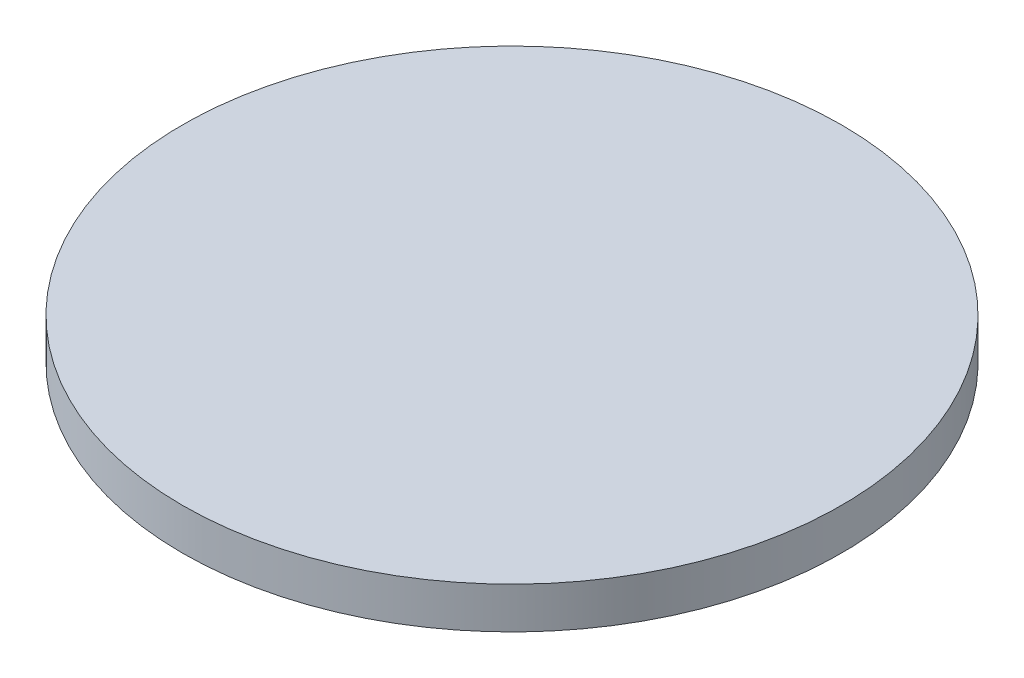
ISO-10303-21;
HEADER;
FILE_DESCRIPTION(('STEP AP214'),'2;1');
FILE_NAME('part.step','',(''),(''),'','','');
FILE_SCHEMA(('AUTOMOTIVE_DESIGN { 1 0 10303 214 1 1 1 1 }'));
ENDSEC;
DATA;
#1=APPLICATION_CONTEXT('core data for automotive mechanical design processes');
#2=APPLICATION_PROTOCOL_DEFINITION('international standard','automotive_design',2000,#1);
#3=PRODUCT_CONTEXT('',#1,'mechanical');
#4=PRODUCT('Part','Part','',(#3));
#5=PRODUCT_RELATED_PRODUCT_CATEGORY('part','',(#4));
#6=PRODUCT_DEFINITION_FORMATION('','',#4);
#7=PRODUCT_DEFINITION_CONTEXT('part definition',#1,'design');
#8=PRODUCT_DEFINITION('design','',#6,#7);
#9=PRODUCT_DEFINITION_SHAPE('','',#8);
#10=(LENGTH_UNIT() NAMED_UNIT(*) SI_UNIT(.MILLI.,.METRE.));
#11=(NAMED_UNIT(*) PLANE_ANGLE_UNIT() SI_UNIT($,.RADIAN.));
#12=(NAMED_UNIT(*) SI_UNIT($,.STERADIAN.) SOLID_ANGLE_UNIT());
#13=UNCERTAINTY_MEASURE_WITH_UNIT(LENGTH_MEASURE(1.E-05),#10,'distance_accuracy_value','');
#14=(GEOMETRIC_REPRESENTATION_CONTEXT(3) GLOBAL_UNCERTAINTY_ASSIGNED_CONTEXT((#13)) GLOBAL_UNIT_ASSIGNED_CONTEXT((#10,
#11,#12)) REPRESENTATION_CONTEXT('',''));
#15=CARTESIAN_POINT('',(0.,0.,0.));
#16=DIRECTION('',(0.,0.,1.));
#17=DIRECTION('',(1.,0.,0.));
#18=AXIS2_PLACEMENT_3D('',#15,#16,#17);
#19=CARTESIAN_POINT('',(0.,5.,0.));
#20=DIRECTION('',(0.,-1.,0.));
#21=DIRECTION('',(0.,0.,-1.));
#22=AXIS2_PLACEMENT_3D('',#19,#20,#21);
#23=CYLINDRICAL_SURFACE('',#22,39.8179700328845);
#24=CARTESIAN_POINT('',(0.,5.,0.));
#25=DIRECTION('',(0.,1.,0.));
#26=DIRECTION('',(0.,0.,1.));
#27=AXIS2_PLACEMENT_3D('',#24,#25,#26);
#28=CIRCLE('',#27,39.8179700328845);
#29=CARTESIAN_POINT('',(0.,5.,39.8179700328845));
#30=VERTEX_POINT('',#29);
#31=EDGE_CURVE('E10',#30,#30,#28,.T.);
#32=ORIENTED_EDGE('',*,*,#31,.F.);
#33=EDGE_LOOP('',(#32));
#34=FACE_BOUND('',#33,.T.);
#35=CARTESIAN_POINT('',(0.,0.,0.));
#36=DIRECTION('',(0.,1.,0.));
#37=DIRECTION('',(0.,0.,1.));
#38=AXIS2_PLACEMENT_3D('',#35,#36,#37);
#39=CIRCLE('',#38,39.8179700328845);
#40=CARTESIAN_POINT('',(0.,0.,39.8179700328845));
#41=VERTEX_POINT('',#40);
#42=EDGE_CURVE('E49',#41,#41,#39,.T.);
#43=ORIENTED_EDGE('',*,*,#42,.T.);
#44=EDGE_LOOP('',(#43));
#45=FACE_BOUND('',#44,.T.);
#46=ADVANCED_FACE('F46',(#34,#45),#23,.T.);
#47=CARTESIAN_POINT('',(0.,5.,0.));
#48=DIRECTION('',(0.,1.,0.));
#49=DIRECTION('',(0.,0.,1.));
#50=AXIS2_PLACEMENT_3D('',#47,#48,#49);
#51=PLANE('',#50);
#52=ORIENTED_EDGE('',*,*,#31,.T.);
#53=EDGE_LOOP('',(#52));
#54=FACE_BOUND('',#53,.T.);
#55=ADVANCED_FACE('F61',(#54),#51,.T.);
#56=CARTESIAN_POINT('',(0.,0.,0.));
#57=DIRECTION('',(0.,1.,0.));
#58=DIRECTION('',(0.,0.,1.));
#59=AXIS2_PLACEMENT_3D('',#56,#57,#58);
#60=PLANE('',#59);
#61=ORIENTED_EDGE('',*,*,#42,.F.);
#62=EDGE_LOOP('',(#61));
#63=FACE_BOUND('',#62,.T.);
#64=ADVANCED_FACE('F59',(#63),#60,.F.);
#65=CLOSED_SHELL('',(#46,#55,#64));
#66=MANIFOLD_SOLID_BREP('B2',#65);
#67=ADVANCED_BREP_SHAPE_REPRESENTATION('',(#18,#66),#14);
#68=SHAPE_DEFINITION_REPRESENTATION(#9,#67);
ENDSEC;
END-ISO-10303-21;
